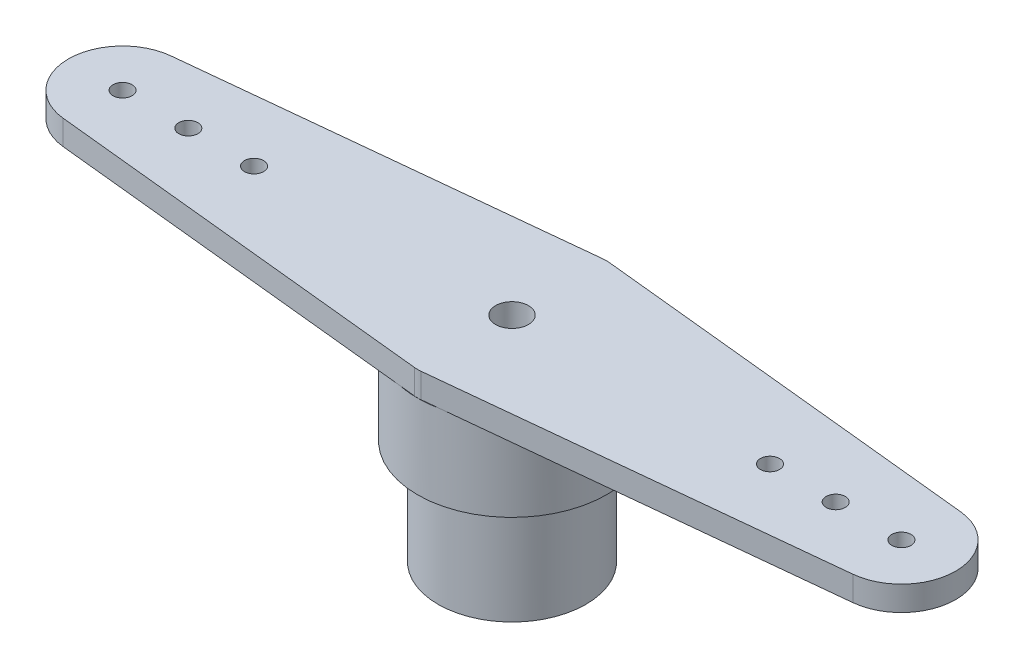
ISO-10303-21;
HEADER;
FILE_DESCRIPTION(('STEP AP214'),'2;1');
FILE_NAME('part.step','',(''),(''),'','','');
FILE_SCHEMA(('AUTOMOTIVE_DESIGN { 1 0 10303 214 1 1 1 1 }'));
ENDSEC;
DATA;
#1=APPLICATION_CONTEXT('core data for automotive mechanical design processes');
#2=APPLICATION_PROTOCOL_DEFINITION('international standard','automotive_design',2000,#1);
#3=PRODUCT_CONTEXT('',#1,'mechanical');
#4=PRODUCT('Part','Part','',(#3));
#5=PRODUCT_RELATED_PRODUCT_CATEGORY('part','',(#4));
#6=PRODUCT_DEFINITION_FORMATION('','',#4);
#7=PRODUCT_DEFINITION_CONTEXT('part definition',#1,'design');
#8=PRODUCT_DEFINITION('design','',#6,#7);
#9=PRODUCT_DEFINITION_SHAPE('','',#8);
#10=(LENGTH_UNIT() NAMED_UNIT(*) SI_UNIT(.MILLI.,.METRE.));
#11=(NAMED_UNIT(*) PLANE_ANGLE_UNIT() SI_UNIT($,.RADIAN.));
#12=(NAMED_UNIT(*) SI_UNIT($,.STERADIAN.) SOLID_ANGLE_UNIT());
#13=UNCERTAINTY_MEASURE_WITH_UNIT(LENGTH_MEASURE(1.E-05),#10,'distance_accuracy_value','');
#14=(GEOMETRIC_REPRESENTATION_CONTEXT(3) GLOBAL_UNCERTAINTY_ASSIGNED_CONTEXT((#13)) GLOBAL_UNIT_ASSIGNED_CONTEXT((#10,
#11,#12)) REPRESENTATION_CONTEXT('',''));
#15=CARTESIAN_POINT('',(0.,0.,0.));
#16=DIRECTION('',(0.,0.,1.));
#17=DIRECTION('',(1.,0.,0.));
#18=AXIS2_PLACEMENT_3D('',#15,#16,#17);
#19=CARTESIAN_POINT('',(0.,-2.55,0.));
#20=DIRECTION('',(0.,1.,0.));
#21=DIRECTION('',(0.,0.,1.));
#22=AXIS2_PLACEMENT_3D('',#19,#20,#21);
#23=PLANE('',#22);
#24=CARTESIAN_POINT('',(0.,-2.55,0.));
#25=DIRECTION('',(0.,1.,0.));
#26=DIRECTION('',(0.,0.,1.));
#27=AXIS2_PLACEMENT_3D('',#24,#25,#26);
#28=CIRCLE('',#27,2.875);
#29=CARTESIAN_POINT('',(0.,-2.55,2.875));
#30=VERTEX_POINT('',#29);
#31=EDGE_CURVE('E212',#30,#30,#28,.T.);
#32=ORIENTED_EDGE('',*,*,#31,.F.);
#33=EDGE_LOOP('',(#32));
#34=FACE_BOUND('',#33,.T.);
#35=CARTESIAN_POINT('',(0.,-2.55,0.));
#36=DIRECTION('',(0.,1.,0.));
#37=DIRECTION('',(0.,0.,1.));
#38=AXIS2_PLACEMENT_3D('',#35,#36,#37);
#39=CIRCLE('',#38,2.25);
#40=CARTESIAN_POINT('',(0.,-2.55,2.25));
#41=VERTEX_POINT('',#40);
#42=EDGE_CURVE('E219',#41,#41,#39,.F.);
#43=ORIENTED_EDGE('',*,*,#42,.F.);
#44=EDGE_LOOP('',(#43));
#45=FACE_BOUND('',#44,.T.);
#46=ADVANCED_FACE('F35',(#34,#45),#23,.F.);
#47=CARTESIAN_POINT('',(0.,0.,0.));
#48=DIRECTION('',(0.,1.,0.));
#49=DIRECTION('',(0.,0.,1.));
#50=AXIS2_PLACEMENT_3D('',#47,#48,#49);
#51=PLANE('',#50);
#52=CARTESIAN_POINT('',(0.,0.,0.));
#53=DIRECTION('',(0.,1.,0.));
#54=DIRECTION('',(0.,0.,1.));
#55=AXIS2_PLACEMENT_3D('',#52,#53,#54);
#56=CIRCLE('',#55,2.875);
#57=CARTESIAN_POINT('',(0.,0.,-2.875));
#58=VERTEX_POINT('',#57);
#59=CARTESIAN_POINT('',(-0.584049273257423,0.,-2.81505087812059));
#60=VERTEX_POINT('',#59);
#61=EDGE_CURVE('E261',#58,#60,#56,.T.);
#62=ORIENTED_EDGE('',*,*,#61,.T.);
#63=DIRECTION('',(0.994773374070749,0.,-0.102107464173283));
#64=VECTOR('',#63,1.);
#65=CARTESIAN_POINT('',(-0.292024636628711,0.,-2.84502543906029));
#66=LINE('',#65,#64);
#67=CARTESIAN_POINT('',(-0.102107464173283,0.,-2.86451928699375));
#68=VERTEX_POINT('',#67);
#69=EDGE_CURVE('E185',#60,#68,#66,.T.);
#70=ORIENTED_EDGE('',*,*,#69,.T.);
#71=CARTESIAN_POINT('',(0.,0.,-1.869745912923));
#72=DIRECTION('',(0.,1.,0.));
#73=DIRECTION('',(0.,0.,1.));
#74=AXIS2_PLACEMENT_3D('',#71,#72,#73);
#75=CIRCLE('',#74,1.);
#76=CARTESIAN_POINT('',(0.102107464173283,0.,-2.86451928699375));
#77=VERTEX_POINT('',#76);
#78=EDGE_CURVE('E11',#68,#77,#75,.F.);
#79=ORIENTED_EDGE('',*,*,#78,.T.);
#80=DIRECTION('',(-0.994773374070749,0.,-0.102107464173283));
#81=VECTOR('',#80,1.);
#82=CARTESIAN_POINT('',(0.292024636628711,0.,-2.84502543906029));
#83=LINE('',#82,#81);
#84=CARTESIAN_POINT('',(0.584049273257423,0.,-2.81505087812059));
#85=VERTEX_POINT('',#84);
#86=EDGE_CURVE('E50',#85,#77,#83,.T.);
#87=ORIENTED_EDGE('',*,*,#86,.F.);
#88=EDGE_CURVE('E263',#85,#58,#56,.T.);
#89=ORIENTED_EDGE('',*,*,#88,.T.);
#90=EDGE_LOOP('',(#62,#70,#79,#87,#89));
#91=FACE_BOUND('',#90,.T.);
#92=ADVANCED_FACE('F259',(#91),#51,.T.);
#93=CARTESIAN_POINT('',(0.,0.,2.875));
#94=VERTEX_POINT('',#93);
#95=CARTESIAN_POINT('',(0.584049273257423,0.,2.81505087812059));
#96=VERTEX_POINT('',#95);
#97=EDGE_CURVE('E215',#94,#96,#56,.T.);
#98=ORIENTED_EDGE('',*,*,#97,.T.);
#99=DIRECTION('',(-0.994773374070749,0.,0.102107464173283));
#100=VECTOR('',#99,1.);
#101=CARTESIAN_POINT('',(0.292024636628711,0.,2.84502543906029));
#102=LINE('',#101,#100);
#103=CARTESIAN_POINT('',(0.102107464173283,0.,2.86451928699375));
#104=VERTEX_POINT('',#103);
#105=EDGE_CURVE('E193',#96,#104,#102,.T.);
#106=ORIENTED_EDGE('',*,*,#105,.T.);
#107=CARTESIAN_POINT('',(0.,0.,1.869745912923));
#108=DIRECTION('',(0.,1.,0.));
#109=DIRECTION('',(0.,0.,1.));
#110=AXIS2_PLACEMENT_3D('',#107,#108,#109);
#111=CIRCLE('',#110,1.);
#112=CARTESIAN_POINT('',(-0.102107464173283,0.,2.86451928699375));
#113=VERTEX_POINT('',#112);
#114=EDGE_CURVE('E43',#104,#113,#111,.F.);
#115=ORIENTED_EDGE('',*,*,#114,.T.);
#116=DIRECTION('',(0.994773374070749,0.,0.102107464173283));
#117=VECTOR('',#116,1.);
#118=CARTESIAN_POINT('',(-0.292024636628711,0.,2.84502543906029));
#119=LINE('',#118,#117);
#120=CARTESIAN_POINT('',(-0.584049273257423,0.,2.81505087812059));
#121=VERTEX_POINT('',#120);
#122=EDGE_CURVE('E57',#121,#113,#119,.T.);
#123=ORIENTED_EDGE('',*,*,#122,.F.);
#124=EDGE_CURVE('E130',#121,#94,#56,.T.);
#125=ORIENTED_EDGE('',*,*,#124,.T.);
#126=EDGE_LOOP('',(#98,#106,#115,#123,#125));
#127=FACE_BOUND('',#126,.T.);
#128=ADVANCED_FACE('F236',(#127),#51,.T.);
#129=CARTESIAN_POINT('',(0.,-2.55,0.));
#130=DIRECTION('',(0.,1.,0.));
#131=DIRECTION('',(0.,0.,1.));
#132=AXIS2_PLACEMENT_3D('',#129,#130,#131);
#133=CYLINDRICAL_SURFACE('',#132,2.875);
#134=ORIENTED_EDGE('',*,*,#31,.T.);
#135=EDGE_LOOP('',(#134));
#136=FACE_BOUND('',#135,.T.);
#137=ORIENTED_EDGE('',*,*,#97,.F.);
#138=ORIENTED_EDGE('',*,*,#124,.F.);
#139=EDGE_CURVE('E265',#60,#121,#56,.T.);
#140=ORIENTED_EDGE('',*,*,#139,.F.);
#141=ORIENTED_EDGE('',*,*,#61,.F.);
#142=ORIENTED_EDGE('',*,*,#88,.F.);
#143=EDGE_CURVE('E218',#96,#85,#56,.T.);
#144=ORIENTED_EDGE('',*,*,#143,.F.);
#145=EDGE_LOOP('',(#137,#138,#140,#141,#142,#144));
#146=FACE_BOUND('',#145,.T.);
#147=ADVANCED_FACE('F268',(#136,#146),#133,.T.);
#148=CARTESIAN_POINT('',(0.,0.,0.));
#149=DIRECTION('',(0.,1.,0.));
#150=DIRECTION('',(0.,0.,1.));
#151=AXIS2_PLACEMENT_3D('',#148,#149,#150);
#152=PLANE('',#151);
#153=CARTESIAN_POINT('',(11.85,0.,0.));
#154=DIRECTION('',(0.,1.,0.));
#155=DIRECTION('',(0.,0.,1.));
#156=AXIS2_PLACEMENT_3D('',#153,#154,#155);
#157=CIRCLE('',#156,0.291434633875756);
#158=CARTESIAN_POINT('',(11.85,0.,0.291434633875756));
#159=VERTEX_POINT('',#158);
#160=EDGE_CURVE('E204',#159,#159,#157,.F.);
#161=ORIENTED_EDGE('',*,*,#160,.F.);
#162=EDGE_LOOP('',(#161));
#163=FACE_BOUND('',#162,.T.);
#164=CARTESIAN_POINT('',(7.85,0.,0.));
#165=DIRECTION('',(0.,1.,0.));
#166=DIRECTION('',(0.,0.,1.));
#167=AXIS2_PLACEMENT_3D('',#164,#165,#166);
#168=CIRCLE('',#167,0.291434633875755);
#169=CARTESIAN_POINT('',(7.85,0.,0.291434633875755));
#170=VERTEX_POINT('',#169);
#171=EDGE_CURVE('E201',#170,#170,#168,.F.);
#172=ORIENTED_EDGE('',*,*,#171,.F.);
#173=EDGE_LOOP('',(#172));
#174=FACE_BOUND('',#173,.T.);
#175=CARTESIAN_POINT('',(9.85,0.,0.));
#176=DIRECTION('',(0.,1.,0.));
#177=DIRECTION('',(0.,0.,1.));
#178=AXIS2_PLACEMENT_3D('',#175,#176,#177);
#179=CIRCLE('',#178,0.291434633875755);
#180=CARTESIAN_POINT('',(9.85,0.,0.291434633875755));
#181=VERTEX_POINT('',#180);
#182=EDGE_CURVE('E198',#181,#181,#179,.F.);
#183=ORIENTED_EDGE('',*,*,#182,.F.);
#184=EDGE_LOOP('',(#183));
#185=FACE_BOUND('',#184,.T.);
#186=CARTESIAN_POINT('',(12.0184773158859,0.,1.64137606721674));
#187=VERTEX_POINT('',#186);
#188=EDGE_CURVE('E189',#187,#96,#102,.T.);
#189=ORIENTED_EDGE('',*,*,#188,.T.);
#190=ORIENTED_EDGE('',*,*,#143,.T.);
#191=CARTESIAN_POINT('',(12.0184773158859,0.,-1.64137606721674));
#192=VERTEX_POINT('',#191);
#193=EDGE_CURVE('E196',#192,#85,#83,.T.);
#194=ORIENTED_EDGE('',*,*,#193,.F.);
#195=CARTESIAN_POINT('',(11.85,0.,0.));
#196=DIRECTION('',(0.,1.,0.));
#197=DIRECTION('',(0.,0.,1.));
#198=AXIS2_PLACEMENT_3D('',#195,#196,#197);
#199=CIRCLE('',#198,1.65);
#200=EDGE_CURVE('E192',#192,#187,#199,.F.);
#201=ORIENTED_EDGE('',*,*,#200,.T.);
#202=EDGE_LOOP('',(#189,#190,#194,#201));
#203=FACE_BOUND('',#202,.T.);
#204=ADVANCED_FACE('F272',(#163,#174,#185,#203),#152,.F.);
#205=CARTESIAN_POINT('',(-11.85,0.,0.));
#206=DIRECTION('',(0.,1.,0.));
#207=DIRECTION('',(0.,0.,1.));
#208=AXIS2_PLACEMENT_3D('',#205,#206,#207);
#209=CIRCLE('',#208,0.291434633875756);
#210=CARTESIAN_POINT('',(-11.85,0.,0.291434633875756));
#211=VERTEX_POINT('',#210);
#212=EDGE_CURVE('E180',#211,#211,#209,.T.);
#213=ORIENTED_EDGE('',*,*,#212,.T.);
#214=EDGE_LOOP('',(#213));
#215=FACE_BOUND('',#214,.T.);
#216=CARTESIAN_POINT('',(-9.85,0.,0.));
#217=DIRECTION('',(0.,1.,0.));
#218=DIRECTION('',(0.,0.,1.));
#219=AXIS2_PLACEMENT_3D('',#216,#217,#218);
#220=CIRCLE('',#219,0.291434633875755);
#221=CARTESIAN_POINT('',(-9.85,0.,0.291434633875755));
#222=VERTEX_POINT('',#221);
#223=EDGE_CURVE('E176',#222,#222,#220,.T.);
#224=ORIENTED_EDGE('',*,*,#223,.T.);
#225=EDGE_LOOP('',(#224));
#226=FACE_BOUND('',#225,.T.);
#227=CARTESIAN_POINT('',(-7.85,0.,0.));
#228=DIRECTION('',(0.,1.,0.));
#229=DIRECTION('',(0.,0.,1.));
#230=AXIS2_PLACEMENT_3D('',#227,#228,#229);
#231=CIRCLE('',#230,0.291434633875755);
#232=CARTESIAN_POINT('',(-7.85,0.,0.291434633875755));
#233=VERTEX_POINT('',#232);
#234=EDGE_CURVE('E173',#233,#233,#231,.T.);
#235=ORIENTED_EDGE('',*,*,#234,.T.);
#236=EDGE_LOOP('',(#235));
#237=FACE_BOUND('',#236,.T.);
#238=CARTESIAN_POINT('',(-12.0184773158859,0.,-1.64137606721674));
#239=VERTEX_POINT('',#238);
#240=EDGE_CURVE('E126',#239,#60,#66,.T.);
#241=ORIENTED_EDGE('',*,*,#240,.T.);
#242=ORIENTED_EDGE('',*,*,#139,.T.);
#243=CARTESIAN_POINT('',(-12.0184773158859,0.,1.64137606721674));
#244=VERTEX_POINT('',#243);
#245=EDGE_CURVE('E187',#244,#121,#119,.T.);
#246=ORIENTED_EDGE('',*,*,#245,.F.);
#247=CARTESIAN_POINT('',(-11.85,0.,0.));
#248=DIRECTION('',(0.,1.,0.));
#249=DIRECTION('',(0.,0.,1.));
#250=AXIS2_PLACEMENT_3D('',#247,#248,#249);
#251=CIRCLE('',#250,1.65);
#252=EDGE_CURVE('E184',#239,#244,#251,.T.);
#253=ORIENTED_EDGE('',*,*,#252,.F.);
#254=EDGE_LOOP('',(#241,#242,#246,#253));
#255=FACE_BOUND('',#254,.T.);
#256=ADVANCED_FACE('F331',(#215,#226,#237,#255),#152,.F.);
#257=CARTESIAN_POINT('',(-0.292024636628711,0.75,-2.84502543906029));
#258=DIRECTION('',(-0.102107464173283,0.,-0.994773374070749));
#259=DIRECTION('',(-0.994773374070749,0.,0.102107464173283));
#260=AXIS2_PLACEMENT_3D('',#257,#258,#259);
#261=PLANE('',#260);
#262=DIRECTION('',(0.994773374070749,0.,-0.102107464173283));
#263=VECTOR('',#262,1.);
#264=CARTESIAN_POINT('',(-0.292024636628711,0.75,-2.84502543906029));
#265=LINE('',#264,#263);
#266=CARTESIAN_POINT('',(-12.0184773158859,0.75,-1.64137606721674));
#267=VERTEX_POINT('',#266);
#268=CARTESIAN_POINT('',(-0.102107464173283,0.75,-2.86451928699375));
#269=VERTEX_POINT('',#268);
#270=EDGE_CURVE('E122',#267,#269,#265,.T.);
#271=ORIENTED_EDGE('',*,*,#270,.T.);
#272=DIRECTION('',(0.,-1.,0.));
#273=VECTOR('',#272,1.);
#274=CARTESIAN_POINT('',(-0.102107464173283,0.,-2.86451928699375));
#275=LINE('',#274,#273);
#276=EDGE_CURVE('E230',#269,#68,#275,.T.);
#277=ORIENTED_EDGE('',*,*,#276,.T.);
#278=ORIENTED_EDGE('',*,*,#69,.F.);
#279=ORIENTED_EDGE('',*,*,#240,.F.);
#280=DIRECTION('',(0.,-1.,0.));
#281=VECTOR('',#280,1.);
#282=CARTESIAN_POINT('',(-12.0184773158859,0.75,-1.64137606721674));
#283=LINE('',#282,#281);
#284=EDGE_CURVE('E117',#267,#239,#283,.T.);
#285=ORIENTED_EDGE('',*,*,#284,.F.);
#286=EDGE_LOOP('',(#271,#277,#278,#279,#285));
#287=FACE_BOUND('',#286,.T.);
#288=ADVANCED_FACE('F119',(#287),#261,.T.);
#289=CARTESIAN_POINT('',(-11.85,0.75,0.));
#290=DIRECTION('',(0.,-1.,0.));
#291=DIRECTION('',(0.,0.,-1.));
#292=AXIS2_PLACEMENT_3D('',#289,#290,#291);
#293=CYLINDRICAL_SURFACE('',#292,1.65);
#294=ORIENTED_EDGE('',*,*,#252,.T.);
#295=DIRECTION('',(0.,-1.,0.));
#296=VECTOR('',#295,1.);
#297=CARTESIAN_POINT('',(-12.0184773158859,0.75,1.64137606721674));
#298=LINE('',#297,#296);
#299=CARTESIAN_POINT('',(-12.0184773158859,0.75,1.64137606721674));
#300=VERTEX_POINT('',#299);
#301=EDGE_CURVE('E131',#300,#244,#298,.T.);
#302=ORIENTED_EDGE('',*,*,#301,.F.);
#303=CARTESIAN_POINT('',(-11.85,0.75,0.));
#304=DIRECTION('',(0.,1.,0.));
#305=DIRECTION('',(0.,0.,1.));
#306=AXIS2_PLACEMENT_3D('',#303,#304,#305);
#307=CIRCLE('',#306,1.65);
#308=EDGE_CURVE('E135',#267,#300,#307,.T.);
#309=ORIENTED_EDGE('',*,*,#308,.F.);
#310=ORIENTED_EDGE('',*,*,#284,.T.);
#311=EDGE_LOOP('',(#294,#302,#309,#310));
#312=FACE_BOUND('',#311,.T.);
#313=ADVANCED_FACE('F136',(#312),#293,.T.);
#314=CARTESIAN_POINT('',(-0.292024636628711,0.75,2.84502543906029));
#315=DIRECTION('',(0.102107464173283,0.,-0.994773374070749));
#316=DIRECTION('',(-0.994773374070749,0.,-0.102107464173283));
#317=AXIS2_PLACEMENT_3D('',#314,#315,#316);
#318=PLANE('',#317);
#319=ORIENTED_EDGE('',*,*,#122,.T.);
#320=DIRECTION('',(0.,-1.,0.));
#321=VECTOR('',#320,1.);
#322=CARTESIAN_POINT('',(-0.102107464173283,0.75,2.86451928699375));
#323=LINE('',#322,#321);
#324=CARTESIAN_POINT('',(-0.102107464173283,0.75,2.86451928699375));
#325=VERTEX_POINT('',#324);
#326=EDGE_CURVE('E225',#113,#325,#323,.F.);
#327=ORIENTED_EDGE('',*,*,#326,.T.);
#328=DIRECTION('',(0.994773374070749,0.,0.102107464173283));
#329=VECTOR('',#328,1.);
#330=CARTESIAN_POINT('',(-0.292024636628711,0.75,2.84502543906029));
#331=LINE('',#330,#329);
#332=EDGE_CURVE('E140',#300,#325,#331,.T.);
#333=ORIENTED_EDGE('',*,*,#332,.F.);
#334=ORIENTED_EDGE('',*,*,#301,.T.);
#335=ORIENTED_EDGE('',*,*,#245,.T.);
#336=EDGE_LOOP('',(#319,#327,#333,#334,#335));
#337=FACE_BOUND('',#336,.T.);
#338=ADVANCED_FACE('F244',(#337),#318,.F.);
#339=CARTESIAN_POINT('',(0.292024636628711,0.75,2.84502543906029));
#340=DIRECTION('',(0.102107464173283,0.,0.994773374070749));
#341=DIRECTION('',(0.994773374070749,0.,-0.102107464173283));
#342=AXIS2_PLACEMENT_3D('',#339,#340,#341);
#343=PLANE('',#342);
#344=DIRECTION('',(-0.994773374070749,0.,0.102107464173283));
#345=VECTOR('',#344,1.);
#346=CARTESIAN_POINT('',(0.292024636628711,0.75,2.84502543906029));
#347=LINE('',#346,#345);
#348=CARTESIAN_POINT('',(12.0184773158859,0.75,1.64137606721674));
#349=VERTEX_POINT('',#348);
#350=CARTESIAN_POINT('',(0.102107464173283,0.75,2.86451928699375));
#351=VERTEX_POINT('',#350);
#352=EDGE_CURVE('E155',#349,#351,#347,.T.);
#353=ORIENTED_EDGE('',*,*,#352,.T.);
#354=DIRECTION('',(0.,-1.,0.));
#355=VECTOR('',#354,1.);
#356=CARTESIAN_POINT('',(0.102107464173283,0.,2.86451928699375));
#357=LINE('',#356,#355);
#358=EDGE_CURVE('E222',#351,#104,#357,.T.);
#359=ORIENTED_EDGE('',*,*,#358,.T.);
#360=ORIENTED_EDGE('',*,*,#105,.F.);
#361=ORIENTED_EDGE('',*,*,#188,.F.);
#362=DIRECTION('',(0.,-1.,0.));
#363=VECTOR('',#362,1.);
#364=CARTESIAN_POINT('',(12.0184773158859,0.75,1.64137606721674));
#365=LINE('',#364,#363);
#366=EDGE_CURVE('E209',#349,#187,#365,.T.);
#367=ORIENTED_EDGE('',*,*,#366,.F.);
#368=EDGE_LOOP('',(#353,#359,#360,#361,#367));
#369=FACE_BOUND('',#368,.T.);
#370=ADVANCED_FACE('F248',(#369),#343,.T.);
#371=CARTESIAN_POINT('',(11.85,0.75,0.));
#372=DIRECTION('',(0.,-1.,0.));
#373=DIRECTION('',(0.,0.,-1.));
#374=AXIS2_PLACEMENT_3D('',#371,#372,#373);
#375=CYLINDRICAL_SURFACE('',#374,1.65);
#376=ORIENTED_EDGE('',*,*,#200,.F.);
#377=DIRECTION('',(0.,-1.,0.));
#378=VECTOR('',#377,1.);
#379=CARTESIAN_POINT('',(12.0184773158859,0.75,-1.64137606721674));
#380=LINE('',#379,#378);
#381=CARTESIAN_POINT('',(12.0184773158859,0.75,-1.64137606721674));
#382=VERTEX_POINT('',#381);
#383=EDGE_CURVE('E172',#382,#192,#380,.T.);
#384=ORIENTED_EDGE('',*,*,#383,.F.);
#385=CARTESIAN_POINT('',(11.85,0.75,0.));
#386=DIRECTION('',(0.,1.,0.));
#387=DIRECTION('',(0.,0.,1.));
#388=AXIS2_PLACEMENT_3D('',#385,#386,#387);
#389=CIRCLE('',#388,1.65);
#390=EDGE_CURVE('E158',#382,#349,#389,.F.);
#391=ORIENTED_EDGE('',*,*,#390,.T.);
#392=ORIENTED_EDGE('',*,*,#366,.T.);
#393=EDGE_LOOP('',(#376,#384,#391,#392));
#394=FACE_BOUND('',#393,.T.);
#395=ADVANCED_FACE('F252',(#394),#375,.T.);
#396=CARTESIAN_POINT('',(7.85,0.75,0.));
#397=DIRECTION('',(0.,-1.,0.));
#398=DIRECTION('',(0.,0.,-1.));
#399=AXIS2_PLACEMENT_3D('',#396,#397,#398);
#400=CYLINDRICAL_SURFACE('',#399,0.291434633875755);
#401=CARTESIAN_POINT('',(7.85,0.75,0.));
#402=DIRECTION('',(0.,1.,0.));
#403=DIRECTION('',(0.,0.,1.));
#404=AXIS2_PLACEMENT_3D('',#401,#402,#403);
#405=CIRCLE('',#404,0.291434633875755);
#406=CARTESIAN_POINT('',(7.85,0.75,0.291434633875755));
#407=VERTEX_POINT('',#406);
#408=EDGE_CURVE('E166',#407,#407,#405,.F.);
#409=ORIENTED_EDGE('',*,*,#408,.F.);
#410=EDGE_LOOP('',(#409));
#411=FACE_BOUND('',#410,.T.);
#412=ORIENTED_EDGE('',*,*,#171,.T.);
#413=EDGE_LOOP('',(#412));
#414=FACE_BOUND('',#413,.T.);
#415=ADVANCED_FACE('F285',(#411,#414),#400,.F.);
#416=CARTESIAN_POINT('',(9.85,0.75,0.));
#417=DIRECTION('',(0.,-1.,0.));
#418=DIRECTION('',(0.,0.,-1.));
#419=AXIS2_PLACEMENT_3D('',#416,#417,#418);
#420=CYLINDRICAL_SURFACE('',#419,0.291434633875755);
#421=CARTESIAN_POINT('',(9.85,0.75,0.));
#422=DIRECTION('',(0.,1.,0.));
#423=DIRECTION('',(0.,0.,1.));
#424=AXIS2_PLACEMENT_3D('',#421,#422,#423);
#425=CIRCLE('',#424,0.291434633875755);
#426=CARTESIAN_POINT('',(9.85,0.75,0.291434633875755));
#427=VERTEX_POINT('',#426);
#428=EDGE_CURVE('E163',#427,#427,#425,.F.);
#429=ORIENTED_EDGE('',*,*,#428,.F.);
#430=EDGE_LOOP('',(#429));
#431=FACE_BOUND('',#430,.T.);
#432=ORIENTED_EDGE('',*,*,#182,.T.);
#433=EDGE_LOOP('',(#432));
#434=FACE_BOUND('',#433,.T.);
#435=ADVANCED_FACE('F276',(#431,#434),#420,.F.);
#436=CARTESIAN_POINT('',(0.292024636628711,0.75,-2.84502543906029));
#437=DIRECTION('',(-0.102107464173283,0.,0.994773374070749));
#438=DIRECTION('',(0.994773374070749,0.,0.102107464173283));
#439=AXIS2_PLACEMENT_3D('',#436,#437,#438);
#440=PLANE('',#439);
#441=ORIENTED_EDGE('',*,*,#86,.T.);
#442=DIRECTION('',(0.,-1.,0.));
#443=VECTOR('',#442,1.);
#444=CARTESIAN_POINT('',(0.102107464173283,0.75,-2.86451928699375));
#445=LINE('',#444,#443);
#446=CARTESIAN_POINT('',(0.102107464173283,0.75,-2.86451928699375));
#447=VERTEX_POINT('',#446);
#448=EDGE_CURVE('E232',#77,#447,#445,.F.);
#449=ORIENTED_EDGE('',*,*,#448,.T.);
#450=DIRECTION('',(-0.994773374070749,0.,-0.102107464173283));
#451=VECTOR('',#450,1.);
#452=CARTESIAN_POINT('',(0.292024636628711,0.75,-2.84502543906029));
#453=LINE('',#452,#451);
#454=EDGE_CURVE('E161',#382,#447,#453,.T.);
#455=ORIENTED_EDGE('',*,*,#454,.F.);
#456=ORIENTED_EDGE('',*,*,#383,.T.);
#457=ORIENTED_EDGE('',*,*,#193,.T.);
#458=EDGE_LOOP('',(#441,#449,#455,#456,#457));
#459=FACE_BOUND('',#458,.T.);
#460=ADVANCED_FACE('F273',(#459),#440,.F.);
#461=CARTESIAN_POINT('',(-11.85,0.75,0.));
#462=DIRECTION('',(0.,-1.,0.));
#463=DIRECTION('',(0.,0.,-1.));
#464=AXIS2_PLACEMENT_3D('',#461,#462,#463);
#465=CYLINDRICAL_SURFACE('',#464,0.291434633875756);
#466=CARTESIAN_POINT('',(-11.85,0.75,0.));
#467=DIRECTION('',(0.,1.,0.));
#468=DIRECTION('',(0.,0.,1.));
#469=AXIS2_PLACEMENT_3D('',#466,#467,#468);
#470=CIRCLE('',#469,0.291434633875756);
#471=CARTESIAN_POINT('',(-11.85,0.75,0.291434633875756));
#472=VERTEX_POINT('',#471);
#473=EDGE_CURVE('E147',#472,#472,#470,.T.);
#474=ORIENTED_EDGE('',*,*,#473,.T.);
#475=EDGE_LOOP('',(#474));
#476=FACE_BOUND('',#475,.T.);
#477=ORIENTED_EDGE('',*,*,#212,.F.);
#478=EDGE_LOOP('',(#477));
#479=FACE_BOUND('',#478,.T.);
#480=ADVANCED_FACE('F275',(#476,#479),#465,.F.);
#481=CARTESIAN_POINT('',(-9.85,0.75,0.));
#482=DIRECTION('',(0.,-1.,0.));
#483=DIRECTION('',(0.,0.,-1.));
#484=AXIS2_PLACEMENT_3D('',#481,#482,#483);
#485=CYLINDRICAL_SURFACE('',#484,0.291434633875755);
#486=CARTESIAN_POINT('',(-9.85,0.75,0.));
#487=DIRECTION('',(0.,1.,0.));
#488=DIRECTION('',(0.,0.,1.));
#489=AXIS2_PLACEMENT_3D('',#486,#487,#488);
#490=CIRCLE('',#489,0.291434633875755);
#491=CARTESIAN_POINT('',(-9.85,0.75,0.291434633875755));
#492=VERTEX_POINT('',#491);
#493=EDGE_CURVE('E150',#492,#492,#490,.T.);
#494=ORIENTED_EDGE('',*,*,#493,.T.);
#495=EDGE_LOOP('',(#494));
#496=FACE_BOUND('',#495,.T.);
#497=ORIENTED_EDGE('',*,*,#223,.F.);
#498=EDGE_LOOP('',(#497));
#499=FACE_BOUND('',#498,.T.);
#500=ADVANCED_FACE('F282',(#496,#499),#485,.F.);
#501=CARTESIAN_POINT('',(-7.85,0.75,0.));
#502=DIRECTION('',(0.,-1.,0.));
#503=DIRECTION('',(0.,0.,-1.));
#504=AXIS2_PLACEMENT_3D('',#501,#502,#503);
#505=CYLINDRICAL_SURFACE('',#504,0.291434633875755);
#506=CARTESIAN_POINT('',(-7.85,0.75,0.));
#507=DIRECTION('',(0.,1.,0.));
#508=DIRECTION('',(0.,0.,1.));
#509=AXIS2_PLACEMENT_3D('',#506,#507,#508);
#510=CIRCLE('',#509,0.291434633875755);
#511=CARTESIAN_POINT('',(-7.85,0.75,0.291434633875755));
#512=VERTEX_POINT('',#511);
#513=EDGE_CURVE('E207',#512,#512,#510,.T.);
#514=ORIENTED_EDGE('',*,*,#513,.T.);
#515=EDGE_LOOP('',(#514));
#516=FACE_BOUND('',#515,.T.);
#517=ORIENTED_EDGE('',*,*,#234,.F.);
#518=EDGE_LOOP('',(#517));
#519=FACE_BOUND('',#518,.T.);
#520=ADVANCED_FACE('F299',(#516,#519),#505,.F.);
#521=CARTESIAN_POINT('',(11.85,0.75,0.));
#522=DIRECTION('',(0.,-1.,0.));
#523=DIRECTION('',(0.,0.,-1.));
#524=AXIS2_PLACEMENT_3D('',#521,#522,#523);
#525=CYLINDRICAL_SURFACE('',#524,0.291434633875756);
#526=CARTESIAN_POINT('',(11.85,0.75,0.));
#527=DIRECTION('',(0.,1.,0.));
#528=DIRECTION('',(0.,0.,1.));
#529=AXIS2_PLACEMENT_3D('',#526,#527,#528);
#530=CIRCLE('',#529,0.291434633875756);
#531=CARTESIAN_POINT('',(11.85,0.75,0.291434633875756));
#532=VERTEX_POINT('',#531);
#533=EDGE_CURVE('E169',#532,#532,#530,.F.);
#534=ORIENTED_EDGE('',*,*,#533,.F.);
#535=EDGE_LOOP('',(#534));
#536=FACE_BOUND('',#535,.T.);
#537=ORIENTED_EDGE('',*,*,#160,.T.);
#538=EDGE_LOOP('',(#537));
#539=FACE_BOUND('',#538,.T.);
#540=ADVANCED_FACE('F327',(#536,#539),#525,.F.);
#541=CARTESIAN_POINT('',(0.,0.75,0.));
#542=DIRECTION('',(0.,1.,0.));
#543=DIRECTION('',(0.,0.,1.));
#544=AXIS2_PLACEMENT_3D('',#541,#542,#543);
#545=PLANE('',#544);
#546=CARTESIAN_POINT('',(0.,0.75,0.));
#547=DIRECTION('',(0.,-1.,0.));
#548=DIRECTION('',(0.,0.,-1.));
#549=AXIS2_PLACEMENT_3D('',#546,#547,#548);
#550=CIRCLE('',#549,0.5);
#551=CARTESIAN_POINT('',(0.,0.75,-0.5));
#552=VERTEX_POINT('',#551);
#553=EDGE_CURVE('E536',#552,#552,#550,.T.);
#554=ORIENTED_EDGE('',*,*,#553,.T.);
#555=EDGE_LOOP('',(#554));
#556=FACE_BOUND('',#555,.T.);
#557=ORIENTED_EDGE('',*,*,#513,.F.);
#558=EDGE_LOOP('',(#557));
#559=FACE_BOUND('',#558,.T.);
#560=ORIENTED_EDGE('',*,*,#493,.F.);
#561=EDGE_LOOP('',(#560));
#562=FACE_BOUND('',#561,.T.);
#563=ORIENTED_EDGE('',*,*,#473,.F.);
#564=EDGE_LOOP('',(#563));
#565=FACE_BOUND('',#564,.T.);
#566=ORIENTED_EDGE('',*,*,#332,.T.);
#567=CARTESIAN_POINT('',(0.,0.75,1.869745912923));
#568=DIRECTION('',(0.,1.,0.));
#569=DIRECTION('',(0.,0.,1.));
#570=AXIS2_PLACEMENT_3D('',#567,#568,#569);
#571=CIRCLE('',#570,1.);
#572=EDGE_CURVE('E228',#325,#351,#571,.T.);
#573=ORIENTED_EDGE('',*,*,#572,.T.);
#574=ORIENTED_EDGE('',*,*,#352,.F.);
#575=ORIENTED_EDGE('',*,*,#390,.F.);
#576=ORIENTED_EDGE('',*,*,#454,.T.);
#577=CARTESIAN_POINT('',(0.,0.75,-1.869745912923));
#578=DIRECTION('',(0.,1.,0.));
#579=DIRECTION('',(0.,0.,1.));
#580=AXIS2_PLACEMENT_3D('',#577,#578,#579);
#581=CIRCLE('',#580,1.);
#582=EDGE_CURVE('E146',#447,#269,#581,.T.);
#583=ORIENTED_EDGE('',*,*,#582,.T.);
#584=ORIENTED_EDGE('',*,*,#270,.F.);
#585=ORIENTED_EDGE('',*,*,#308,.T.);
#586=EDGE_LOOP('',(#566,#573,#574,#575,#576,#583,#584,#585));
#587=FACE_BOUND('',#586,.T.);
#588=ORIENTED_EDGE('',*,*,#428,.T.);
#589=EDGE_LOOP('',(#588));
#590=FACE_BOUND('',#589,.T.);
#591=ORIENTED_EDGE('',*,*,#408,.T.);
#592=EDGE_LOOP('',(#591));
#593=FACE_BOUND('',#592,.T.);
#594=ORIENTED_EDGE('',*,*,#533,.T.);
#595=EDGE_LOOP('',(#594));
#596=FACE_BOUND('',#595,.T.);
#597=ADVANCED_FACE('F142',(#556,#559,#562,#565,#587,#590,#593,#596),#545,.T.);
#598=CARTESIAN_POINT('',(0.,-5.75,0.));
#599=DIRECTION('',(0.,1.,0.));
#600=DIRECTION('',(0.,0.,1.));
#601=AXIS2_PLACEMENT_3D('',#598,#599,#600);
#602=CYLINDRICAL_SURFACE('',#601,2.25);
#603=CARTESIAN_POINT('',(0.,-5.75,0.));
#604=DIRECTION('',(0.,-1.,0.));
#605=DIRECTION('',(0.,0.,-1.));
#606=AXIS2_PLACEMENT_3D('',#603,#604,#605);
#607=CIRCLE('',#606,2.25);
#608=CARTESIAN_POINT('',(0.,-5.75,-2.25));
#609=VERTEX_POINT('',#608);
#610=EDGE_CURVE('E177',#609,#609,#607,.T.);
#611=ORIENTED_EDGE('',*,*,#610,.F.);
#612=EDGE_LOOP('',(#611));
#613=FACE_BOUND('',#612,.T.);
#614=ORIENTED_EDGE('',*,*,#42,.T.);
#615=EDGE_LOOP('',(#614));
#616=FACE_BOUND('',#615,.T.);
#617=ADVANCED_FACE('F316',(#613,#616),#602,.T.);
#618=CARTESIAN_POINT('',(0.,-5.75,0.));
#619=DIRECTION('',(0.,-1.,0.));
#620=DIRECTION('',(0.,0.,-1.));
#621=AXIS2_PLACEMENT_3D('',#618,#619,#620);
#622=PLANE('',#621);
#623=CARTESIAN_POINT('',(0.,-5.75,0.));
#624=DIRECTION('',(0.,-1.,0.));
#625=DIRECTION('',(0.,0.,-1.));
#626=AXIS2_PLACEMENT_3D('',#623,#624,#625);
#627=CIRCLE('',#626,0.5);
#628=CARTESIAN_POINT('',(0.,-5.75,-0.5));
#629=VERTEX_POINT('',#628);
#630=EDGE_CURVE('E537',#629,#629,#627,.T.);
#631=ORIENTED_EDGE('',*,*,#630,.F.);
#632=EDGE_LOOP('',(#631));
#633=FACE_BOUND('',#632,.T.);
#634=ORIENTED_EDGE('',*,*,#610,.T.);
#635=EDGE_LOOP('',(#634));
#636=FACE_BOUND('',#635,.T.);
#637=ADVANCED_FACE('F310',(#633,#636),#622,.T.);
#638=CARTESIAN_POINT('',(0.,0.75,0.));
#639=DIRECTION('',(0.,-1.,0.));
#640=DIRECTION('',(0.,0.,-1.));
#641=AXIS2_PLACEMENT_3D('',#638,#639,#640);
#642=CYLINDRICAL_SURFACE('',#641,0.5);
#643=ORIENTED_EDGE('',*,*,#553,.F.);
#644=EDGE_LOOP('',(#643));
#645=FACE_BOUND('',#644,.T.);
#646=ORIENTED_EDGE('',*,*,#630,.T.);
#647=EDGE_LOOP('',(#646));
#648=FACE_BOUND('',#647,.T.);
#649=ADVANCED_FACE('F305',(#645,#648),#642,.F.);
#650=CARTESIAN_POINT('',(0.,0.75,1.869745912923));
#651=DIRECTION('',(0.,1.,0.));
#652=DIRECTION('',(0.,0.,1.));
#653=AXIS2_PLACEMENT_3D('',#650,#651,#652);
#654=CYLINDRICAL_SURFACE('',#653,1.);
#655=ORIENTED_EDGE('',*,*,#572,.F.);
#656=ORIENTED_EDGE('',*,*,#326,.F.);
#657=ORIENTED_EDGE('',*,*,#114,.F.);
#658=ORIENTED_EDGE('',*,*,#358,.F.);
#659=EDGE_LOOP('',(#655,#656,#657,#658));
#660=FACE_BOUND('',#659,.T.);
#661=ADVANCED_FACE('F243',(#660),#654,.T.);
#662=CARTESIAN_POINT('',(0.,0.75,-1.869745912923));
#663=DIRECTION('',(0.,1.,0.));
#664=DIRECTION('',(0.,0.,1.));
#665=AXIS2_PLACEMENT_3D('',#662,#663,#664);
#666=CYLINDRICAL_SURFACE('',#665,1.);
#667=ORIENTED_EDGE('',*,*,#582,.F.);
#668=ORIENTED_EDGE('',*,*,#448,.F.);
#669=ORIENTED_EDGE('',*,*,#78,.F.);
#670=ORIENTED_EDGE('',*,*,#276,.F.);
#671=EDGE_LOOP('',(#667,#668,#669,#670));
#672=FACE_BOUND('',#671,.T.);
#673=ADVANCED_FACE('F37',(#672),#666,.T.);
#674=CLOSED_SHELL('',(#46,#92,#128,#147,#204,#256,#288,#313,#338,#370,#395,#415,#435,#460,#480,
#500,#520,#540,#597,#617,#637,#649,#661,#673));
#675=MANIFOLD_SOLID_BREP('B2',#674);
#676=ADVANCED_BREP_SHAPE_REPRESENTATION('',(#18,#675),#14);
#677=SHAPE_DEFINITION_REPRESENTATION(#9,#676);
ENDSEC;
END-ISO-10303-21;
